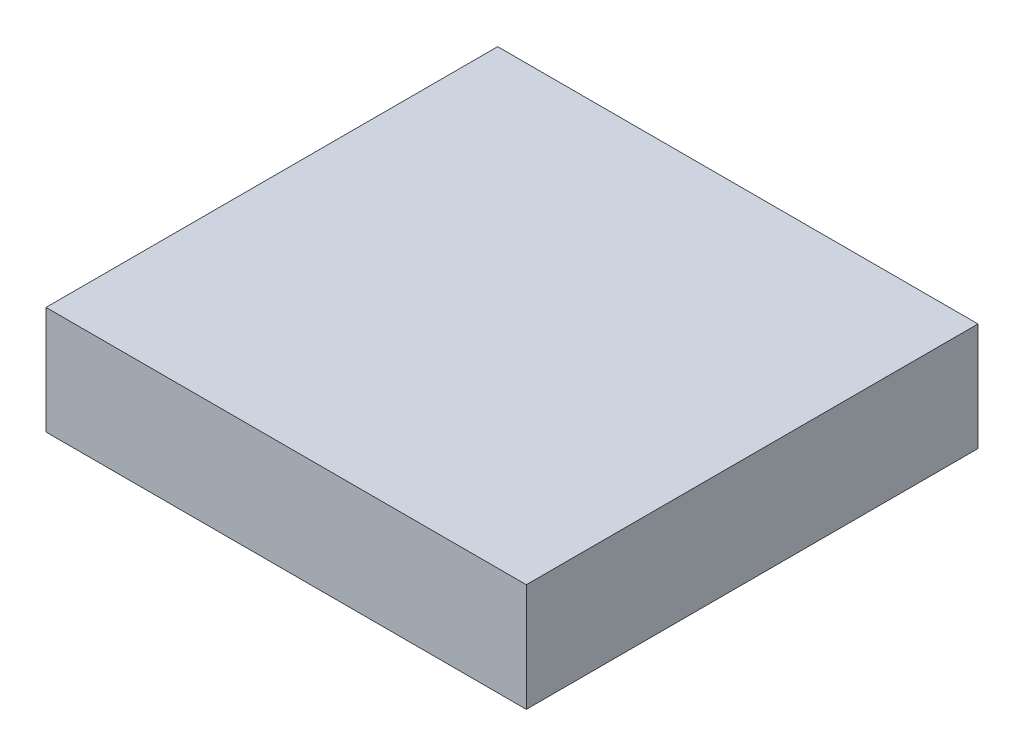
ISO-10303-21;
HEADER;
FILE_DESCRIPTION(('STEP AP214'),'2;1');
FILE_NAME('part.step','',(''),(''),'','','');
FILE_SCHEMA(('AUTOMOTIVE_DESIGN { 1 0 10303 214 1 1 1 1 }'));
ENDSEC;
DATA;
#1=APPLICATION_CONTEXT('core data for automotive mechanical design processes');
#2=APPLICATION_PROTOCOL_DEFINITION('international standard','automotive_design',2000,#1);
#3=PRODUCT_CONTEXT('',#1,'mechanical');
#4=PRODUCT('Part','Part','',(#3));
#5=PRODUCT_RELATED_PRODUCT_CATEGORY('part','',(#4));
#6=PRODUCT_DEFINITION_FORMATION('','',#4);
#7=PRODUCT_DEFINITION_CONTEXT('part definition',#1,'design');
#8=PRODUCT_DEFINITION('design','',#6,#7);
#9=PRODUCT_DEFINITION_SHAPE('','',#8);
#10=(LENGTH_UNIT() NAMED_UNIT(*) SI_UNIT(.MILLI.,.METRE.));
#11=(NAMED_UNIT(*) PLANE_ANGLE_UNIT() SI_UNIT($,.RADIAN.));
#12=(NAMED_UNIT(*) SI_UNIT($,.STERADIAN.) SOLID_ANGLE_UNIT());
#13=UNCERTAINTY_MEASURE_WITH_UNIT(LENGTH_MEASURE(1.E-05),#10,'distance_accuracy_value','');
#14=(GEOMETRIC_REPRESENTATION_CONTEXT(3) GLOBAL_UNCERTAINTY_ASSIGNED_CONTEXT((#13)) GLOBAL_UNIT_ASSIGNED_CONTEXT((#10,
#11,#12)) REPRESENTATION_CONTEXT('',''));
#15=CARTESIAN_POINT('',(0.,0.,0.));
#16=DIRECTION('',(0.,0.,1.));
#17=DIRECTION('',(1.,0.,0.));
#18=AXIS2_PLACEMENT_3D('',#15,#16,#17);
#19=CARTESIAN_POINT('',(-47.895,10.775,-45.085));
#20=DIRECTION('',(1.,0.,0.));
#21=DIRECTION('',(0.,0.,-1.));
#22=AXIS2_PLACEMENT_3D('',#19,#20,#21);
#23=PLANE('',#22);
#24=DIRECTION('',(0.,0.,1.));
#25=VECTOR('',#24,1.);
#26=CARTESIAN_POINT('',(-47.895,-10.775,-45.085));
#27=LINE('',#26,#25);
#28=CARTESIAN_POINT('',(-47.895,-10.775,-45.085));
#29=VERTEX_POINT('',#28);
#30=CARTESIAN_POINT('',(-47.895,-10.775,45.085));
#31=VERTEX_POINT('',#30);
#32=EDGE_CURVE('E117',#29,#31,#27,.T.);
#33=ORIENTED_EDGE('',*,*,#32,.T.);
#34=DIRECTION('',(0.,-1.,0.));
#35=VECTOR('',#34,1.);
#36=CARTESIAN_POINT('',(-47.895,10.775,45.085));
#37=LINE('',#36,#35);
#38=CARTESIAN_POINT('',(-47.895,10.775,45.085));
#39=VERTEX_POINT('',#38);
#40=EDGE_CURVE('E11',#39,#31,#37,.T.);
#41=ORIENTED_EDGE('',*,*,#40,.F.);
#42=DIRECTION('',(0.,0.,1.));
#43=VECTOR('',#42,1.);
#44=CARTESIAN_POINT('',(-47.895,10.775,-45.085));
#45=LINE('',#44,#43);
#46=CARTESIAN_POINT('',(-47.895,10.775,-45.085));
#47=VERTEX_POINT('',#46);
#48=EDGE_CURVE('E101',#47,#39,#45,.T.);
#49=ORIENTED_EDGE('',*,*,#48,.F.);
#50=DIRECTION('',(0.,-1.,0.));
#51=VECTOR('',#50,1.);
#52=CARTESIAN_POINT('',(-47.895,10.775,-45.085));
#53=LINE('',#52,#51);
#54=EDGE_CURVE('E113',#47,#29,#53,.T.);
#55=ORIENTED_EDGE('',*,*,#54,.T.);
#56=EDGE_LOOP('',(#33,#41,#49,#55));
#57=FACE_BOUND('',#56,.T.);
#58=ADVANCED_FACE('F49',(#57),#23,.F.);
#59=CARTESIAN_POINT('',(-47.895,10.775,45.085));
#60=DIRECTION('',(0.,0.,-1.));
#61=DIRECTION('',(-1.,0.,0.));
#62=AXIS2_PLACEMENT_3D('',#59,#60,#61);
#63=PLANE('',#62);
#64=DIRECTION('',(1.,0.,0.));
#65=VECTOR('',#64,1.);
#66=CARTESIAN_POINT('',(-47.895,-10.775,45.085));
#67=LINE('',#66,#65);
#68=CARTESIAN_POINT('',(47.995,-10.775,45.085));
#69=VERTEX_POINT('',#68);
#70=EDGE_CURVE('E106',#31,#69,#67,.T.);
#71=ORIENTED_EDGE('',*,*,#70,.T.);
#72=DIRECTION('',(0.,-1.,0.));
#73=VECTOR('',#72,1.);
#74=CARTESIAN_POINT('',(47.995,10.775,45.085));
#75=LINE('',#74,#73);
#76=CARTESIAN_POINT('',(47.995,10.775,45.085));
#77=VERTEX_POINT('',#76);
#78=EDGE_CURVE('E58',#77,#69,#75,.T.);
#79=ORIENTED_EDGE('',*,*,#78,.F.);
#80=DIRECTION('',(1.,0.,0.));
#81=VECTOR('',#80,1.);
#82=CARTESIAN_POINT('',(-47.895,10.775,45.085));
#83=LINE('',#82,#81);
#84=EDGE_CURVE('E96',#39,#77,#83,.T.);
#85=ORIENTED_EDGE('',*,*,#84,.F.);
#86=ORIENTED_EDGE('',*,*,#40,.T.);
#87=EDGE_LOOP('',(#71,#79,#85,#86));
#88=FACE_BOUND('',#87,.T.);
#89=ADVANCED_FACE('F105',(#88),#63,.F.);
#90=CARTESIAN_POINT('',(47.995,10.775,-45.085));
#91=DIRECTION('',(-1.,0.,0.));
#92=DIRECTION('',(0.,0.,1.));
#93=AXIS2_PLACEMENT_3D('',#90,#91,#92);
#94=PLANE('',#93);
#95=DIRECTION('',(0.,0.,-1.));
#96=VECTOR('',#95,1.);
#97=CARTESIAN_POINT('',(47.995,-10.775,-45.085));
#98=LINE('',#97,#96);
#99=CARTESIAN_POINT('',(47.995,-10.775,-45.085));
#100=VERTEX_POINT('',#99);
#101=EDGE_CURVE('E83',#69,#100,#98,.T.);
#102=ORIENTED_EDGE('',*,*,#101,.T.);
#103=DIRECTION('',(0.,-1.,0.));
#104=VECTOR('',#103,1.);
#105=CARTESIAN_POINT('',(47.995,10.775,-45.085));
#106=LINE('',#105,#104);
#107=CARTESIAN_POINT('',(47.995,10.775,-45.085));
#108=VERTEX_POINT('',#107);
#109=EDGE_CURVE('E108',#108,#100,#106,.T.);
#110=ORIENTED_EDGE('',*,*,#109,.F.);
#111=DIRECTION('',(0.,0.,-1.));
#112=VECTOR('',#111,1.);
#113=CARTESIAN_POINT('',(47.995,10.775,-45.085));
#114=LINE('',#113,#112);
#115=EDGE_CURVE('E99',#77,#108,#114,.T.);
#116=ORIENTED_EDGE('',*,*,#115,.F.);
#117=ORIENTED_EDGE('',*,*,#78,.T.);
#118=EDGE_LOOP('',(#102,#110,#116,#117));
#119=FACE_BOUND('',#118,.T.);
#120=ADVANCED_FACE('F109',(#119),#94,.F.);
#121=CARTESIAN_POINT('',(-47.895,10.775,-45.085));
#122=DIRECTION('',(0.,0.,1.));
#123=DIRECTION('',(1.,0.,0.));
#124=AXIS2_PLACEMENT_3D('',#121,#122,#123);
#125=PLANE('',#124);
#126=DIRECTION('',(-1.,0.,0.));
#127=VECTOR('',#126,1.);
#128=CARTESIAN_POINT('',(-47.895,-10.775,-45.085));
#129=LINE('',#128,#127);
#130=EDGE_CURVE('E89',#100,#29,#129,.T.);
#131=ORIENTED_EDGE('',*,*,#130,.T.);
#132=ORIENTED_EDGE('',*,*,#54,.F.);
#133=DIRECTION('',(-1.,0.,0.));
#134=VECTOR('',#133,1.);
#135=CARTESIAN_POINT('',(-47.895,10.775,-45.085));
#136=LINE('',#135,#134);
#137=EDGE_CURVE('E66',#108,#47,#136,.T.);
#138=ORIENTED_EDGE('',*,*,#137,.F.);
#139=ORIENTED_EDGE('',*,*,#109,.T.);
#140=EDGE_LOOP('',(#131,#132,#138,#139));
#141=FACE_BOUND('',#140,.T.);
#142=ADVANCED_FACE('F130',(#141),#125,.F.);
#143=CARTESIAN_POINT('',(0.,10.775,0.));
#144=DIRECTION('',(0.,1.,0.));
#145=DIRECTION('',(0.,0.,1.));
#146=AXIS2_PLACEMENT_3D('',#143,#144,#145);
#147=PLANE('',#146);
#148=ORIENTED_EDGE('',*,*,#48,.T.);
#149=ORIENTED_EDGE('',*,*,#84,.T.);
#150=ORIENTED_EDGE('',*,*,#115,.T.);
#151=ORIENTED_EDGE('',*,*,#137,.T.);
#152=EDGE_LOOP('',(#148,#149,#150,#151));
#153=FACE_BOUND('',#152,.T.);
#154=ADVANCED_FACE('F97',(#153),#147,.T.);
#155=CARTESIAN_POINT('',(0.,-10.775,0.));
#156=DIRECTION('',(0.,1.,0.));
#157=DIRECTION('',(0.,0.,1.));
#158=AXIS2_PLACEMENT_3D('',#155,#156,#157);
#159=PLANE('',#158);
#160=ORIENTED_EDGE('',*,*,#32,.F.);
#161=ORIENTED_EDGE('',*,*,#130,.F.);
#162=ORIENTED_EDGE('',*,*,#101,.F.);
#163=ORIENTED_EDGE('',*,*,#70,.F.);
#164=EDGE_LOOP('',(#160,#161,#162,#163));
#165=FACE_BOUND('',#164,.T.);
#166=ADVANCED_FACE('F133',(#165),#159,.F.);
#167=CLOSED_SHELL('',(#58,#89,#120,#142,#154,#166));
#168=MANIFOLD_SOLID_BREP('B2',#167);
#169=ADVANCED_BREP_SHAPE_REPRESENTATION('',(#18,#168),#14);
#170=SHAPE_DEFINITION_REPRESENTATION(#9,#169);
ENDSEC;
END-ISO-10303-21;
